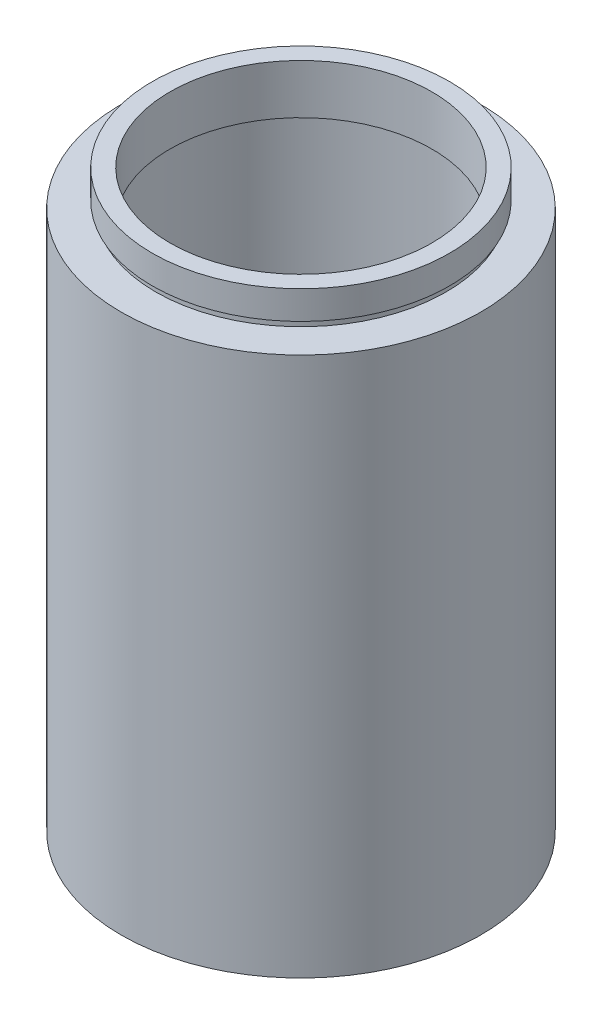
ISO-10303-21;
HEADER;
FILE_DESCRIPTION(('STEP AP214'),'2;1');
FILE_NAME('part.step','',(''),(''),'','','');
FILE_SCHEMA(('AUTOMOTIVE_DESIGN { 1 0 10303 214 1 1 1 1 }'));
ENDSEC;
DATA;
#1=APPLICATION_CONTEXT('core data for automotive mechanical design processes');
#2=APPLICATION_PROTOCOL_DEFINITION('international standard','automotive_design',2000,#1);
#3=PRODUCT_CONTEXT('',#1,'mechanical');
#4=PRODUCT('Part','Part','',(#3));
#5=PRODUCT_RELATED_PRODUCT_CATEGORY('part','',(#4));
#6=PRODUCT_DEFINITION_FORMATION('','',#4);
#7=PRODUCT_DEFINITION_CONTEXT('part definition',#1,'design');
#8=PRODUCT_DEFINITION('design','',#6,#7);
#9=PRODUCT_DEFINITION_SHAPE('','',#8);
#10=(LENGTH_UNIT() NAMED_UNIT(*) SI_UNIT(.MILLI.,.METRE.));
#11=(NAMED_UNIT(*) PLANE_ANGLE_UNIT() SI_UNIT($,.RADIAN.));
#12=(NAMED_UNIT(*) SI_UNIT($,.STERADIAN.) SOLID_ANGLE_UNIT());
#13=UNCERTAINTY_MEASURE_WITH_UNIT(LENGTH_MEASURE(1.E-05),#10,'distance_accuracy_value','');
#14=(GEOMETRIC_REPRESENTATION_CONTEXT(3) GLOBAL_UNCERTAINTY_ASSIGNED_CONTEXT((#13)) GLOBAL_UNIT_ASSIGNED_CONTEXT((#10,
#11,#12)) REPRESENTATION_CONTEXT('',''));
#15=CARTESIAN_POINT('',(0.,0.,0.));
#16=DIRECTION('',(0.,0.,1.));
#17=DIRECTION('',(1.,0.,0.));
#18=AXIS2_PLACEMENT_3D('',#15,#16,#17);
#19=CARTESIAN_POINT('',(0.,161.376166943427,0.));
#20=DIRECTION('',(0.,1.,0.));
#21=DIRECTION('',(0.,0.,1.));
#22=AXIS2_PLACEMENT_3D('',#19,#20,#21);
#23=CYLINDRICAL_SURFACE('',#22,18.5);
#24=CARTESIAN_POINT('',(0.,74.2,0.));
#25=DIRECTION('',(0.,1.,0.));
#26=DIRECTION('',(0.,0.,1.));
#27=AXIS2_PLACEMENT_3D('',#24,#25,#26);
#28=CIRCLE('',#27,18.5);
#29=CARTESIAN_POINT('',(0.,74.2,18.5));
#30=VERTEX_POINT('',#29);
#31=EDGE_CURVE('E75',#30,#30,#28,.T.);
#32=ORIENTED_EDGE('',*,*,#31,.F.);
#33=EDGE_LOOP('',(#32));
#34=FACE_BOUND('',#33,.T.);
#35=CARTESIAN_POINT('',(0.,81.2,0.));
#36=DIRECTION('',(0.,1.,0.));
#37=DIRECTION('',(0.,0.,1.));
#38=AXIS2_PLACEMENT_3D('',#35,#36,#37);
#39=CIRCLE('',#38,18.5);
#40=CARTESIAN_POINT('',(0.,81.2,18.5));
#41=VERTEX_POINT('',#40);
#42=EDGE_CURVE('E10',#41,#41,#39,.T.);
#43=ORIENTED_EDGE('',*,*,#42,.T.);
#44=EDGE_LOOP('',(#43));
#45=FACE_BOUND('',#44,.T.);
#46=ADVANCED_FACE('F35',(#34,#45),#23,.F.);
#47=CARTESIAN_POINT('',(18.5,81.2,0.));
#48=DIRECTION('',(0.,-1.,0.));
#49=DIRECTION('',(0.,0.,-1.));
#50=AXIS2_PLACEMENT_3D('',#47,#48,#49);
#51=PLANE('',#50);
#52=ORIENTED_EDGE('',*,*,#42,.F.);
#53=EDGE_LOOP('',(#52));
#54=FACE_BOUND('',#53,.T.);
#55=CARTESIAN_POINT('',(0.,81.2,0.));
#56=DIRECTION('',(0.,1.,0.));
#57=DIRECTION('',(0.,0.,1.));
#58=AXIS2_PLACEMENT_3D('',#55,#56,#57);
#59=CIRCLE('',#58,21.);
#60=CARTESIAN_POINT('',(0.,81.2,21.));
#61=VERTEX_POINT('',#60);
#62=EDGE_CURVE('E41',#61,#61,#59,.T.);
#63=ORIENTED_EDGE('',*,*,#62,.T.);
#64=EDGE_LOOP('',(#63));
#65=FACE_BOUND('',#64,.T.);
#66=ADVANCED_FACE('F82',(#54,#65),#51,.F.);
#67=CARTESIAN_POINT('',(0.,161.376166943427,0.));
#68=DIRECTION('',(0.,1.,0.));
#69=DIRECTION('',(0.,0.,1.));
#70=AXIS2_PLACEMENT_3D('',#67,#68,#69);
#71=CYLINDRICAL_SURFACE('',#70,21.);
#72=ORIENTED_EDGE('',*,*,#62,.F.);
#73=EDGE_LOOP('',(#72));
#74=FACE_BOUND('',#73,.T.);
#75=CARTESIAN_POINT('',(0.,77.2,0.));
#76=DIRECTION('',(0.,1.,0.));
#77=DIRECTION('',(0.,0.,1.));
#78=AXIS2_PLACEMENT_3D('',#75,#76,#77);
#79=CIRCLE('',#78,21.);
#80=CARTESIAN_POINT('',(0.,77.2,21.));
#81=VERTEX_POINT('',#80);
#82=EDGE_CURVE('E45',#81,#81,#79,.T.);
#83=ORIENTED_EDGE('',*,*,#82,.T.);
#84=EDGE_LOOP('',(#83));
#85=FACE_BOUND('',#84,.T.);
#86=ADVANCED_FACE('F86',(#74,#85),#71,.T.);
#87=CARTESIAN_POINT('',(21.,77.2,0.));
#88=DIRECTION('',(0.,1.,0.));
#89=DIRECTION('',(0.,0.,1.));
#90=AXIS2_PLACEMENT_3D('',#87,#88,#89);
#91=PLANE('',#90);
#92=ORIENTED_EDGE('',*,*,#82,.F.);
#93=EDGE_LOOP('',(#92));
#94=FACE_BOUND('',#93,.T.);
#95=CARTESIAN_POINT('',(0.,77.2,0.));
#96=DIRECTION('',(0.,1.,0.));
#97=DIRECTION('',(0.,0.,1.));
#98=AXIS2_PLACEMENT_3D('',#95,#96,#97);
#99=CIRCLE('',#98,20.5);
#100=CARTESIAN_POINT('',(0.,77.2,20.5));
#101=VERTEX_POINT('',#100);
#102=EDGE_CURVE('E49',#101,#101,#99,.T.);
#103=ORIENTED_EDGE('',*,*,#102,.T.);
#104=EDGE_LOOP('',(#103));
#105=FACE_BOUND('',#104,.T.);
#106=ADVANCED_FACE('F91',(#94,#105),#91,.F.);
#107=CARTESIAN_POINT('',(0.,161.376166943427,0.));
#108=DIRECTION('',(0.,1.,0.));
#109=DIRECTION('',(0.,0.,1.));
#110=AXIS2_PLACEMENT_3D('',#107,#108,#109);
#111=CYLINDRICAL_SURFACE('',#110,20.5);
#112=ORIENTED_EDGE('',*,*,#102,.F.);
#113=EDGE_LOOP('',(#112));
#114=FACE_BOUND('',#113,.T.);
#115=CARTESIAN_POINT('',(0.,76.2,0.));
#116=DIRECTION('',(0.,1.,0.));
#117=DIRECTION('',(0.,0.,1.));
#118=AXIS2_PLACEMENT_3D('',#115,#116,#117);
#119=CIRCLE('',#118,20.5);
#120=CARTESIAN_POINT('',(0.,76.2,20.5));
#121=VERTEX_POINT('',#120);
#122=EDGE_CURVE('E54',#121,#121,#119,.T.);
#123=ORIENTED_EDGE('',*,*,#122,.T.);
#124=EDGE_LOOP('',(#123));
#125=FACE_BOUND('',#124,.T.);
#126=ADVANCED_FACE('F97',(#114,#125),#111,.T.);
#127=CARTESIAN_POINT('',(20.5,76.2,0.));
#128=DIRECTION('',(0.,-1.,0.));
#129=DIRECTION('',(0.,0.,-1.));
#130=AXIS2_PLACEMENT_3D('',#127,#128,#129);
#131=PLANE('',#130);
#132=ORIENTED_EDGE('',*,*,#122,.F.);
#133=EDGE_LOOP('',(#132));
#134=FACE_BOUND('',#133,.T.);
#135=CARTESIAN_POINT('',(0.,76.2,0.));
#136=DIRECTION('',(0.,1.,0.));
#137=DIRECTION('',(0.,0.,1.));
#138=AXIS2_PLACEMENT_3D('',#135,#136,#137);
#139=CIRCLE('',#138,25.4);
#140=CARTESIAN_POINT('',(0.,76.2,25.4));
#141=VERTEX_POINT('',#140);
#142=EDGE_CURVE('E57',#141,#141,#139,.T.);
#143=ORIENTED_EDGE('',*,*,#142,.T.);
#144=EDGE_LOOP('',(#143));
#145=FACE_BOUND('',#144,.T.);
#146=ADVANCED_FACE('F101',(#134,#145),#131,.F.);
#147=CARTESIAN_POINT('',(0.,161.376166943427,0.));
#148=DIRECTION('',(0.,1.,0.));
#149=DIRECTION('',(0.,0.,1.));
#150=AXIS2_PLACEMENT_3D('',#147,#148,#149);
#151=CYLINDRICAL_SURFACE('',#150,25.4);
#152=ORIENTED_EDGE('',*,*,#142,.F.);
#153=EDGE_LOOP('',(#152));
#154=FACE_BOUND('',#153,.T.);
#155=CARTESIAN_POINT('',(0.,0.,0.));
#156=DIRECTION('',(0.,1.,0.));
#157=DIRECTION('',(0.,0.,1.));
#158=AXIS2_PLACEMENT_3D('',#155,#156,#157);
#159=CIRCLE('',#158,25.4);
#160=CARTESIAN_POINT('',(0.,0.,25.4));
#161=VERTEX_POINT('',#160);
#162=EDGE_CURVE('E60',#161,#161,#159,.T.);
#163=ORIENTED_EDGE('',*,*,#162,.T.);
#164=EDGE_LOOP('',(#163));
#165=FACE_BOUND('',#164,.T.);
#166=ADVANCED_FACE('F105',(#154,#165),#151,.T.);
#167=CARTESIAN_POINT('',(25.4,0.,0.));
#168=DIRECTION('',(0.,1.,0.));
#169=DIRECTION('',(0.,0.,1.));
#170=AXIS2_PLACEMENT_3D('',#167,#168,#169);
#171=PLANE('',#170);
#172=ORIENTED_EDGE('',*,*,#162,.F.);
#173=EDGE_LOOP('',(#172));
#174=FACE_BOUND('',#173,.T.);
#175=CARTESIAN_POINT('',(0.,0.,0.));
#176=DIRECTION('',(0.,1.,0.));
#177=DIRECTION('',(0.,0.,1.));
#178=AXIS2_PLACEMENT_3D('',#175,#176,#177);
#179=CIRCLE('',#178,20.5);
#180=CARTESIAN_POINT('',(0.,0.,20.5));
#181=VERTEX_POINT('',#180);
#182=EDGE_CURVE('E63',#181,#181,#179,.T.);
#183=ORIENTED_EDGE('',*,*,#182,.T.);
#184=EDGE_LOOP('',(#183));
#185=FACE_BOUND('',#184,.T.);
#186=ADVANCED_FACE('F109',(#174,#185),#171,.F.);
#187=CARTESIAN_POINT('',(0.,161.376166943427,0.));
#188=DIRECTION('',(0.,1.,0.));
#189=DIRECTION('',(0.,0.,1.));
#190=AXIS2_PLACEMENT_3D('',#187,#188,#189);
#191=CYLINDRICAL_SURFACE('',#190,20.5);
#192=ORIENTED_EDGE('',*,*,#182,.F.);
#193=EDGE_LOOP('',(#192));
#194=FACE_BOUND('',#193,.T.);
#195=CARTESIAN_POINT('',(0.,73.2,0.));
#196=DIRECTION('',(0.,1.,0.));
#197=DIRECTION('',(0.,0.,1.));
#198=AXIS2_PLACEMENT_3D('',#195,#196,#197);
#199=CIRCLE('',#198,20.5);
#200=CARTESIAN_POINT('',(0.,73.2,20.5));
#201=VERTEX_POINT('',#200);
#202=EDGE_CURVE('E66',#201,#201,#199,.T.);
#203=ORIENTED_EDGE('',*,*,#202,.T.);
#204=EDGE_LOOP('',(#203));
#205=FACE_BOUND('',#204,.T.);
#206=ADVANCED_FACE('F113',(#194,#205),#191,.F.);
#207=CARTESIAN_POINT('',(20.5,73.2,0.));
#208=DIRECTION('',(0.,-1.,0.));
#209=DIRECTION('',(0.,0.,-1.));
#210=AXIS2_PLACEMENT_3D('',#207,#208,#209);
#211=PLANE('',#210);
#212=ORIENTED_EDGE('',*,*,#202,.F.);
#213=EDGE_LOOP('',(#212));
#214=FACE_BOUND('',#213,.T.);
#215=CARTESIAN_POINT('',(0.,73.2,0.));
#216=DIRECTION('',(0.,1.,0.));
#217=DIRECTION('',(0.,0.,1.));
#218=AXIS2_PLACEMENT_3D('',#215,#216,#217);
#219=CIRCLE('',#218,21.1);
#220=CARTESIAN_POINT('',(0.,73.2,21.1));
#221=VERTEX_POINT('',#220);
#222=EDGE_CURVE('E69',#221,#221,#219,.T.);
#223=ORIENTED_EDGE('',*,*,#222,.T.);
#224=EDGE_LOOP('',(#223));
#225=FACE_BOUND('',#224,.T.);
#226=ADVANCED_FACE('F117',(#214,#225),#211,.F.);
#227=CARTESIAN_POINT('',(0.,161.376166943427,0.));
#228=DIRECTION('',(0.,1.,0.));
#229=DIRECTION('',(0.,0.,1.));
#230=AXIS2_PLACEMENT_3D('',#227,#228,#229);
#231=CYLINDRICAL_SURFACE('',#230,21.1);
#232=ORIENTED_EDGE('',*,*,#222,.F.);
#233=EDGE_LOOP('',(#232));
#234=FACE_BOUND('',#233,.T.);
#235=CARTESIAN_POINT('',(0.,74.2,0.));
#236=DIRECTION('',(0.,1.,0.));
#237=DIRECTION('',(0.,0.,1.));
#238=AXIS2_PLACEMENT_3D('',#235,#236,#237);
#239=CIRCLE('',#238,21.1);
#240=CARTESIAN_POINT('',(0.,74.2,21.1));
#241=VERTEX_POINT('',#240);
#242=EDGE_CURVE('E72',#241,#241,#239,.T.);
#243=ORIENTED_EDGE('',*,*,#242,.T.);
#244=EDGE_LOOP('',(#243));
#245=FACE_BOUND('',#244,.T.);
#246=ADVANCED_FACE('F121',(#234,#245),#231,.F.);
#247=CARTESIAN_POINT('',(21.1,74.2,0.));
#248=DIRECTION('',(0.,1.,0.));
#249=DIRECTION('',(0.,0.,1.));
#250=AXIS2_PLACEMENT_3D('',#247,#248,#249);
#251=PLANE('',#250);
#252=ORIENTED_EDGE('',*,*,#242,.F.);
#253=EDGE_LOOP('',(#252));
#254=FACE_BOUND('',#253,.T.);
#255=ORIENTED_EDGE('',*,*,#31,.T.);
#256=EDGE_LOOP('',(#255));
#257=FACE_BOUND('',#256,.T.);
#258=ADVANCED_FACE('F79',(#254,#257),#251,.F.);
#259=CLOSED_SHELL('',(#46,#66,#86,#106,#126,#146,#166,#186,#206,#226,#246,#258));
#260=MANIFOLD_SOLID_BREP('B2',#259);
#261=ADVANCED_BREP_SHAPE_REPRESENTATION('',(#18,#260),#14);
#262=SHAPE_DEFINITION_REPRESENTATION(#9,#261);
ENDSEC;
END-ISO-10303-21;
